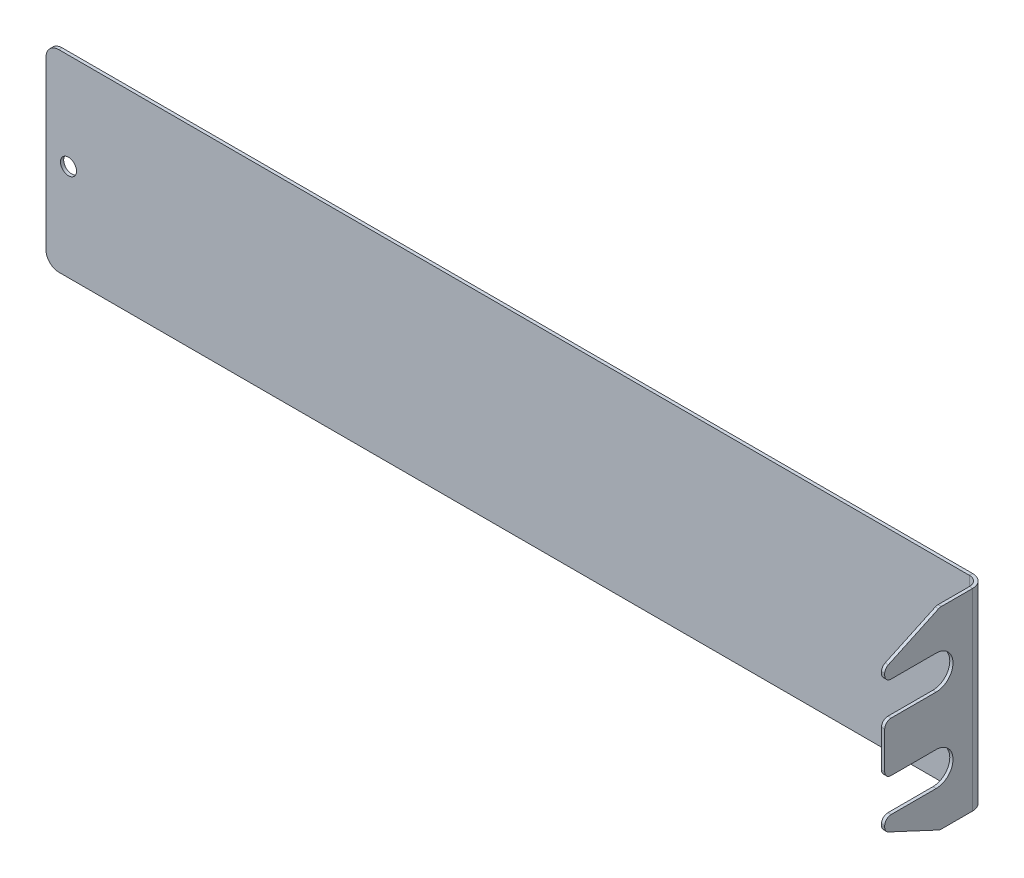
ISO-10303-21;
HEADER;
FILE_DESCRIPTION(('STEP AP214'),'2;1');
FILE_NAME('part.step','',(''),(''),'','','');
FILE_SCHEMA(('AUTOMOTIVE_DESIGN { 1 0 10303 214 1 1 1 1 }'));
ENDSEC;
DATA;
#1=APPLICATION_CONTEXT('core data for automotive mechanical design processes');
#2=APPLICATION_PROTOCOL_DEFINITION('international standard','automotive_design',2000,#1);
#3=PRODUCT_CONTEXT('',#1,'mechanical');
#4=PRODUCT('Part','Part','',(#3));
#5=PRODUCT_RELATED_PRODUCT_CATEGORY('part','',(#4));
#6=PRODUCT_DEFINITION_FORMATION('','',#4);
#7=PRODUCT_DEFINITION_CONTEXT('part definition',#1,'design');
#8=PRODUCT_DEFINITION('design','',#6,#7);
#9=PRODUCT_DEFINITION_SHAPE('','',#8);
#10=(LENGTH_UNIT() NAMED_UNIT(*) SI_UNIT(.MILLI.,.METRE.));
#11=(NAMED_UNIT(*) PLANE_ANGLE_UNIT() SI_UNIT($,.RADIAN.));
#12=(NAMED_UNIT(*) SI_UNIT($,.STERADIAN.) SOLID_ANGLE_UNIT());
#13=UNCERTAINTY_MEASURE_WITH_UNIT(LENGTH_MEASURE(1.E-05),#10,'distance_accuracy_value','');
#14=(GEOMETRIC_REPRESENTATION_CONTEXT(3) GLOBAL_UNCERTAINTY_ASSIGNED_CONTEXT((#13)) GLOBAL_UNIT_ASSIGNED_CONTEXT((#10,
#11,#12)) REPRESENTATION_CONTEXT('',''));
#15=CARTESIAN_POINT('',(0.,0.,0.));
#16=DIRECTION('',(0.,0.,1.));
#17=DIRECTION('',(1.,0.,0.));
#18=AXIS2_PLACEMENT_3D('',#15,#16,#17);
#19=CARTESIAN_POINT('',(0.384624115886447,13.,15.3846241158865));
#20=DIRECTION('',(-1.,0.,0.));
#21=DIRECTION('',(0.,0.,1.));
#22=AXIS2_PLACEMENT_3D('',#19,#20,#21);
#23=PLANE('',#22);
#24=DIRECTION('',(0.,0.,-1.));
#25=VECTOR('',#24,1.);
#26=CARTESIAN_POINT('',(0.38462411588645,30.,13.7851794265242));
#27=LINE('',#26,#25);
#28=CARTESIAN_POINT('',(0.38462411588645,30.,13.7851794265242));
#29=VERTEX_POINT('',#28);
#30=CARTESIAN_POINT('',(0.384624115886484,30.,4.00000000000001));
#31=VERTEX_POINT('',#30);
#32=EDGE_CURVE('E299',#29,#31,#27,.T.);
#33=ORIENTED_EDGE('',*,*,#32,.T.);
#34=DIRECTION('',(0.,-1.,0.));
#35=VECTOR('',#34,1.);
#36=CARTESIAN_POINT('',(0.384624115886487,13.,4.00000000000001));
#37=LINE('',#36,#35);
#38=CARTESIAN_POINT('',(0.384624115886492,-30.0000000000001,4.00000000000001));
#39=VERTEX_POINT('',#38);
#40=EDGE_CURVE('E429',#31,#39,#37,.T.);
#41=ORIENTED_EDGE('',*,*,#40,.T.);
#42=DIRECTION('',(0.,0.,1.));
#43=VECTOR('',#42,1.);
#44=CARTESIAN_POINT('',(0.384624115886458,-30.,13.7851794265242));
#45=LINE('',#44,#43);
#46=CARTESIAN_POINT('',(0.384624115886458,-30.,13.7851794265242));
#47=VERTEX_POINT('',#46);
#48=EDGE_CURVE('E302',#39,#47,#45,.T.);
#49=ORIENTED_EDGE('',*,*,#48,.T.);
#50=CARTESIAN_POINT('',(0.384624115886457,-28.,13.7851794265242));
#51=DIRECTION('',(-1.,0.,0.));
#52=DIRECTION('',(0.,0.,-1.));
#53=AXIS2_PLACEMENT_3D('',#50,#51,#52);
#54=CIRCLE('',#53,2.00000000000001);
#55=CARTESIAN_POINT('',(0.384624115886455,-29.8126155740733,14.6304159500056));
#56=VERTEX_POINT('',#55);
#57=EDGE_CURVE('E304',#47,#56,#54,.T.);
#58=ORIENTED_EDGE('',*,*,#57,.T.);
#59=DIRECTION('',(0.,0.4226182617407,0.90630778703665));
#60=VECTOR('',#59,1.);
#61=CARTESIAN_POINT('',(0.384624115886399,-22.5384750524583,30.2298606393679));
#62=LINE('',#61,#60);
#63=CARTESIAN_POINT('',(0.384624115886399,-22.5384750524583,30.2298606393679));
#64=VERTEX_POINT('',#63);
#65=EDGE_CURVE('E306',#56,#64,#62,.T.);
#66=ORIENTED_EDGE('',*,*,#65,.T.);
#67=CARTESIAN_POINT('',(0.384624115886402,-20.725859478385,29.3846241158865));
#68=DIRECTION('',(-1.,0.,0.));
#69=DIRECTION('',(0.,0.,1.));
#70=AXIS2_PLACEMENT_3D('',#67,#68,#69);
#71=CIRCLE('',#70,2.);
#72=CARTESIAN_POINT('',(0.384624115886395,-20.725859478385,31.3846241158865));
#73=VERTEX_POINT('',#72);
#74=EDGE_CURVE('E308',#64,#73,#71,.T.);
#75=ORIENTED_EDGE('',*,*,#74,.T.);
#76=DIRECTION('',(0.,1.,0.));
#77=VECTOR('',#76,1.);
#78=CARTESIAN_POINT('',(0.384624115886395,-20.25,31.3846241158865));
#79=LINE('',#78,#77);
#80=CARTESIAN_POINT('',(0.384624115886395,-20.25,31.3846241158865));
#81=VERTEX_POINT('',#80);
#82=EDGE_CURVE('E310',#73,#81,#79,.T.);
#83=ORIENTED_EDGE('',*,*,#82,.T.);
#84=CARTESIAN_POINT('',(0.384624115886402,-20.25,29.3846241158865));
#85=DIRECTION('',(-1.,0.,0.));
#86=DIRECTION('',(0.,0.,1.));
#87=AXIS2_PLACEMENT_3D('',#84,#85,#86);
#88=CIRCLE('',#87,2.00000000000001);
#89=CARTESIAN_POINT('',(0.384624115886402,-18.25,29.3846241158865));
#90=VERTEX_POINT('',#89);
#91=EDGE_CURVE('E312',#81,#90,#88,.T.);
#92=ORIENTED_EDGE('',*,*,#91,.T.);
#93=DIRECTION('',(0.,0.,-1.));
#94=VECTOR('',#93,1.);
#95=CARTESIAN_POINT('',(0.384624115886451,-18.25,15.3846241158865));
#96=LINE('',#95,#94);
#97=CARTESIAN_POINT('',(0.384624115886451,-18.25,15.3846241158865));
#98=VERTEX_POINT('',#97);
#99=EDGE_CURVE('E314',#90,#98,#96,.T.);
#100=ORIENTED_EDGE('',*,*,#99,.T.);
#101=CARTESIAN_POINT('',(0.38462411588645,-13.,15.3846241158865));
#102=DIRECTION('',(1.,0.,0.));
#103=DIRECTION('',(0.,0.,-1.));
#104=AXIS2_PLACEMENT_3D('',#101,#102,#103);
#105=CIRCLE('',#104,5.25);
#106=CARTESIAN_POINT('',(0.384624115886449,-7.75,15.3846241158865));
#107=VERTEX_POINT('',#106);
#108=EDGE_CURVE('E316',#98,#107,#105,.T.);
#109=ORIENTED_EDGE('',*,*,#108,.T.);
#110=DIRECTION('',(0.,0.,1.));
#111=VECTOR('',#110,1.);
#112=CARTESIAN_POINT('',(0.384624115886449,-7.75,15.3846241158865));
#113=LINE('',#112,#111);
#114=CARTESIAN_POINT('',(0.3846241158864,-7.74999999999999,29.3846241158865));
#115=VERTEX_POINT('',#114);
#116=EDGE_CURVE('E318',#107,#115,#113,.T.);
#117=ORIENTED_EDGE('',*,*,#116,.T.);
#118=CARTESIAN_POINT('',(0.3846241158864,-5.75,29.3846241158865));
#119=DIRECTION('',(-1.,0.,0.));
#120=DIRECTION('',(0.,0.,-1.));
#121=AXIS2_PLACEMENT_3D('',#118,#119,#120);
#122=CIRCLE('',#121,2.);
#123=CARTESIAN_POINT('',(0.384624115886393,-5.75,31.3846241158865));
#124=VERTEX_POINT('',#123);
#125=EDGE_CURVE('E320',#115,#124,#122,.T.);
#126=ORIENTED_EDGE('',*,*,#125,.T.);
#127=DIRECTION('',(0.,1.,0.));
#128=VECTOR('',#127,1.);
#129=CARTESIAN_POINT('',(0.384624115886392,5.75,31.3846241158865));
#130=LINE('',#129,#128);
#131=CARTESIAN_POINT('',(0.384624115886392,5.75,31.3846241158865));
#132=VERTEX_POINT('',#131);
#133=EDGE_CURVE('E322',#124,#132,#130,.T.);
#134=ORIENTED_EDGE('',*,*,#133,.T.);
#135=CARTESIAN_POINT('',(0.384624115886399,5.75,29.3846241158865));
#136=DIRECTION('',(-1.,0.,0.));
#137=DIRECTION('',(0.,0.,1.));
#138=AXIS2_PLACEMENT_3D('',#135,#136,#137);
#139=CIRCLE('',#138,2.);
#140=CARTESIAN_POINT('',(0.384624115886399,7.74999999999999,29.3846241158865));
#141=VERTEX_POINT('',#140);
#142=EDGE_CURVE('E324',#132,#141,#139,.T.);
#143=ORIENTED_EDGE('',*,*,#142,.T.);
#144=DIRECTION('',(0.,0.,-1.));
#145=VECTOR('',#144,1.);
#146=CARTESIAN_POINT('',(0.384624115886448,7.75,15.3846241158865));
#147=LINE('',#146,#145);
#148=CARTESIAN_POINT('',(0.384624115886448,7.75,15.3846241158865));
#149=VERTEX_POINT('',#148);
#150=EDGE_CURVE('E326',#141,#149,#147,.T.);
#151=ORIENTED_EDGE('',*,*,#150,.T.);
#152=CARTESIAN_POINT('',(0.384624115886447,13.,15.3846241158865));
#153=DIRECTION('',(1.,0.,0.));
#154=DIRECTION('',(0.,0.,1.));
#155=AXIS2_PLACEMENT_3D('',#152,#153,#154);
#156=CIRCLE('',#155,5.25);
#157=CARTESIAN_POINT('',(0.384624115886446,18.25,15.3846241158865));
#158=VERTEX_POINT('',#157);
#159=EDGE_CURVE('E283',#149,#158,#156,.T.);
#160=ORIENTED_EDGE('',*,*,#159,.T.);
#161=DIRECTION('',(0.,0.,1.));
#162=VECTOR('',#161,1.);
#163=CARTESIAN_POINT('',(0.384624115886446,18.25,15.3846241158865));
#164=LINE('',#163,#162);
#165=CARTESIAN_POINT('',(0.384624115886397,18.25,29.3846241158865));
#166=VERTEX_POINT('',#165);
#167=EDGE_CURVE('E286',#158,#166,#164,.T.);
#168=ORIENTED_EDGE('',*,*,#167,.T.);
#169=CARTESIAN_POINT('',(0.384624115886397,20.25,29.3846241158865));
#170=DIRECTION('',(-1.,0.,0.));
#171=DIRECTION('',(0.,0.,-1.));
#172=AXIS2_PLACEMENT_3D('',#169,#170,#171);
#173=CIRCLE('',#172,2.);
#174=CARTESIAN_POINT('',(0.38462411588639,20.25,31.3846241158865));
#175=VERTEX_POINT('',#174);
#176=EDGE_CURVE('E289',#166,#175,#173,.T.);
#177=ORIENTED_EDGE('',*,*,#176,.T.);
#178=DIRECTION('',(0.,1.,0.));
#179=VECTOR('',#178,1.);
#180=CARTESIAN_POINT('',(0.38462411588639,20.25,31.3846241158865));
#181=LINE('',#180,#179);
#182=CARTESIAN_POINT('',(0.38462411588639,20.725859478385,31.3846241158865));
#183=VERTEX_POINT('',#182);
#184=EDGE_CURVE('E291',#175,#183,#181,.T.);
#185=ORIENTED_EDGE('',*,*,#184,.T.);
#186=CARTESIAN_POINT('',(0.384624115886397,20.725859478385,29.3846241158865));
#187=DIRECTION('',(-1.,0.,0.));
#188=DIRECTION('',(0.,0.,-1.));
#189=AXIS2_PLACEMENT_3D('',#186,#187,#188);
#190=CIRCLE('',#189,2.);
#191=CARTESIAN_POINT('',(0.384624115886394,22.5384750524583,30.2298606393679));
#192=VERTEX_POINT('',#191);
#193=EDGE_CURVE('E293',#183,#192,#190,.T.);
#194=ORIENTED_EDGE('',*,*,#193,.T.);
#195=DIRECTION('',(0.,0.4226182617407,-0.90630778703665));
#196=VECTOR('',#195,1.);
#197=CARTESIAN_POINT('',(0.384624115886394,22.5384750524583,30.2298606393679));
#198=LINE('',#197,#196);
#199=CARTESIAN_POINT('',(0.384624115886447,29.8126155740733,14.6304159500056));
#200=VERTEX_POINT('',#199);
#201=EDGE_CURVE('E295',#192,#200,#198,.T.);
#202=ORIENTED_EDGE('',*,*,#201,.T.);
#203=CARTESIAN_POINT('',(0.38462411588645,28.,13.7851794265242));
#204=DIRECTION('',(-1.,0.,0.));
#205=DIRECTION('',(0.,0.,1.));
#206=AXIS2_PLACEMENT_3D('',#203,#204,#205);
#207=CIRCLE('',#206,2.00000000000001);
#208=EDGE_CURVE('E297',#200,#29,#207,.T.);
#209=ORIENTED_EDGE('',*,*,#208,.T.);
#210=EDGE_LOOP('',(#33,#41,#49,#58,#66,#75,#83,#92,#100,#109,#117,#126,#134,#143,#151,#160,#168,
#177,#185,#194,#202,#209));
#211=FACE_BOUND('',#210,.T.);
#212=ADVANCED_FACE('F39',(#211),#23,.T.);
#213=CARTESIAN_POINT('',(1.38462411588645,13.,15.3846241158865));
#214=DIRECTION('',(-1.,0.,0.));
#215=DIRECTION('',(0.,0.,1.));
#216=AXIS2_PLACEMENT_3D('',#213,#214,#215);
#217=PLANE('',#216);
#218=DIRECTION('',(0.,-1.,0.));
#219=VECTOR('',#218,1.);
#220=CARTESIAN_POINT('',(1.38462411588649,13.,4.00000000000001));
#221=LINE('',#220,#219);
#222=CARTESIAN_POINT('',(1.38462411588648,30.,4.00000000000001));
#223=VERTEX_POINT('',#222);
#224=CARTESIAN_POINT('',(1.38462411588649,-30.,4.00000000000001));
#225=VERTEX_POINT('',#224);
#226=EDGE_CURVE('E54',#223,#225,#221,.T.);
#227=ORIENTED_EDGE('',*,*,#226,.F.);
#228=DIRECTION('',(0.,0.,-1.));
#229=VECTOR('',#228,1.);
#230=CARTESIAN_POINT('',(1.38462411588645,30.,13.7851794265242));
#231=LINE('',#230,#229);
#232=CARTESIAN_POINT('',(1.38462411588645,30.,13.7851794265242));
#233=VERTEX_POINT('',#232);
#234=EDGE_CURVE('E343',#233,#223,#231,.T.);
#235=ORIENTED_EDGE('',*,*,#234,.F.);
#236=CARTESIAN_POINT('',(1.38462411588645,28.,13.7851794265242));
#237=DIRECTION('',(-1.,0.,0.));
#238=DIRECTION('',(0.,0.,1.));
#239=AXIS2_PLACEMENT_3D('',#236,#237,#238);
#240=CIRCLE('',#239,2.00000000000001);
#241=CARTESIAN_POINT('',(1.38462411588645,29.8126155740733,14.6304159500056));
#242=VERTEX_POINT('',#241);
#243=EDGE_CURVE('E341',#242,#233,#240,.T.);
#244=ORIENTED_EDGE('',*,*,#243,.F.);
#245=DIRECTION('',(0.,0.4226182617407,-0.90630778703665));
#246=VECTOR('',#245,1.);
#247=CARTESIAN_POINT('',(1.38462411588639,22.5384750524583,30.2298606393679));
#248=LINE('',#247,#246);
#249=CARTESIAN_POINT('',(1.38462411588639,22.5384750524583,30.2298606393679));
#250=VERTEX_POINT('',#249);
#251=EDGE_CURVE('E339',#250,#242,#248,.T.);
#252=ORIENTED_EDGE('',*,*,#251,.F.);
#253=CARTESIAN_POINT('',(1.3846241158864,20.725859478385,29.3846241158865));
#254=DIRECTION('',(-1.,0.,0.));
#255=DIRECTION('',(0.,0.,-1.));
#256=AXIS2_PLACEMENT_3D('',#253,#254,#255);
#257=CIRCLE('',#256,2.);
#258=CARTESIAN_POINT('',(1.38462411588639,20.725859478385,31.3846241158865));
#259=VERTEX_POINT('',#258);
#260=EDGE_CURVE('E337',#259,#250,#257,.T.);
#261=ORIENTED_EDGE('',*,*,#260,.F.);
#262=DIRECTION('',(0.,1.,0.));
#263=VECTOR('',#262,1.);
#264=CARTESIAN_POINT('',(1.38462411588639,20.25,31.3846241158865));
#265=LINE('',#264,#263);
#266=CARTESIAN_POINT('',(1.38462411588639,20.25,31.3846241158865));
#267=VERTEX_POINT('',#266);
#268=EDGE_CURVE('E335',#267,#259,#265,.T.);
#269=ORIENTED_EDGE('',*,*,#268,.F.);
#270=CARTESIAN_POINT('',(1.3846241158864,20.25,29.3846241158865));
#271=DIRECTION('',(-1.,0.,0.));
#272=DIRECTION('',(0.,0.,-1.));
#273=AXIS2_PLACEMENT_3D('',#270,#271,#272);
#274=CIRCLE('',#273,2.);
#275=CARTESIAN_POINT('',(1.3846241158864,18.25,29.3846241158865));
#276=VERTEX_POINT('',#275);
#277=EDGE_CURVE('E333',#276,#267,#274,.T.);
#278=ORIENTED_EDGE('',*,*,#277,.F.);
#279=DIRECTION('',(0.,0.,1.));
#280=VECTOR('',#279,1.);
#281=CARTESIAN_POINT('',(1.38462411588645,18.25,15.3846241158865));
#282=LINE('',#281,#280);
#283=CARTESIAN_POINT('',(1.38462411588645,18.25,15.3846241158865));
#284=VERTEX_POINT('',#283);
#285=EDGE_CURVE('E331',#284,#276,#282,.T.);
#286=ORIENTED_EDGE('',*,*,#285,.F.);
#287=CARTESIAN_POINT('',(1.38462411588645,13.,15.3846241158865));
#288=DIRECTION('',(1.,0.,0.));
#289=DIRECTION('',(0.,0.,1.));
#290=AXIS2_PLACEMENT_3D('',#287,#288,#289);
#291=CIRCLE('',#290,5.25);
#292=CARTESIAN_POINT('',(1.38462411588645,7.75,15.3846241158865));
#293=VERTEX_POINT('',#292);
#294=EDGE_CURVE('E282',#293,#284,#291,.T.);
#295=ORIENTED_EDGE('',*,*,#294,.F.);
#296=DIRECTION('',(0.,0.,-1.));
#297=VECTOR('',#296,1.);
#298=CARTESIAN_POINT('',(1.38462411588645,7.75,15.3846241158865));
#299=LINE('',#298,#297);
#300=CARTESIAN_POINT('',(1.3846241158864,7.74999999999999,29.3846241158865));
#301=VERTEX_POINT('',#300);
#302=EDGE_CURVE('E287',#301,#293,#299,.T.);
#303=ORIENTED_EDGE('',*,*,#302,.F.);
#304=CARTESIAN_POINT('',(1.3846241158864,5.75,29.3846241158865));
#305=DIRECTION('',(-1.,0.,0.));
#306=DIRECTION('',(0.,0.,1.));
#307=AXIS2_PLACEMENT_3D('',#304,#305,#306);
#308=CIRCLE('',#307,2.);
#309=CARTESIAN_POINT('',(1.38462411588639,5.75,31.3846241158865));
#310=VERTEX_POINT('',#309);
#311=EDGE_CURVE('E367',#310,#301,#308,.T.);
#312=ORIENTED_EDGE('',*,*,#311,.F.);
#313=DIRECTION('',(0.,1.,0.));
#314=VECTOR('',#313,1.);
#315=CARTESIAN_POINT('',(1.38462411588639,5.75,31.3846241158865));
#316=LINE('',#315,#314);
#317=CARTESIAN_POINT('',(1.38462411588639,-5.75,31.3846241158865));
#318=VERTEX_POINT('',#317);
#319=EDGE_CURVE('E365',#318,#310,#316,.T.);
#320=ORIENTED_EDGE('',*,*,#319,.F.);
#321=CARTESIAN_POINT('',(1.3846241158864,-5.75,29.3846241158865));
#322=DIRECTION('',(-1.,0.,0.));
#323=DIRECTION('',(0.,0.,-1.));
#324=AXIS2_PLACEMENT_3D('',#321,#322,#323);
#325=CIRCLE('',#324,2.);
#326=CARTESIAN_POINT('',(1.3846241158864,-7.74999999999999,29.3846241158865));
#327=VERTEX_POINT('',#326);
#328=EDGE_CURVE('E363',#327,#318,#325,.T.);
#329=ORIENTED_EDGE('',*,*,#328,.F.);
#330=DIRECTION('',(0.,0.,1.));
#331=VECTOR('',#330,1.);
#332=CARTESIAN_POINT('',(1.38462411588645,-7.75,15.3846241158865));
#333=LINE('',#332,#331);
#334=CARTESIAN_POINT('',(1.38462411588645,-7.75,15.3846241158865));
#335=VERTEX_POINT('',#334);
#336=EDGE_CURVE('E361',#335,#327,#333,.T.);
#337=ORIENTED_EDGE('',*,*,#336,.F.);
#338=CARTESIAN_POINT('',(1.38462411588645,-13.,15.3846241158865));
#339=DIRECTION('',(1.,0.,0.));
#340=DIRECTION('',(0.,0.,-1.));
#341=AXIS2_PLACEMENT_3D('',#338,#339,#340);
#342=CIRCLE('',#341,5.25);
#343=CARTESIAN_POINT('',(1.38462411588645,-18.25,15.3846241158865));
#344=VERTEX_POINT('',#343);
#345=EDGE_CURVE('E359',#344,#335,#342,.T.);
#346=ORIENTED_EDGE('',*,*,#345,.F.);
#347=DIRECTION('',(0.,0.,-1.));
#348=VECTOR('',#347,1.);
#349=CARTESIAN_POINT('',(1.38462411588645,-18.25,15.3846241158865));
#350=LINE('',#349,#348);
#351=CARTESIAN_POINT('',(1.3846241158864,-18.25,29.3846241158865));
#352=VERTEX_POINT('',#351);
#353=EDGE_CURVE('E357',#352,#344,#350,.T.);
#354=ORIENTED_EDGE('',*,*,#353,.F.);
#355=CARTESIAN_POINT('',(1.3846241158864,-20.25,29.3846241158865));
#356=DIRECTION('',(-1.,0.,0.));
#357=DIRECTION('',(0.,0.,1.));
#358=AXIS2_PLACEMENT_3D('',#355,#356,#357);
#359=CIRCLE('',#358,2.00000000000001);
#360=CARTESIAN_POINT('',(1.3846241158864,-20.25,31.3846241158865));
#361=VERTEX_POINT('',#360);
#362=EDGE_CURVE('E355',#361,#352,#359,.T.);
#363=ORIENTED_EDGE('',*,*,#362,.F.);
#364=DIRECTION('',(0.,1.,0.));
#365=VECTOR('',#364,1.);
#366=CARTESIAN_POINT('',(1.3846241158864,-20.25,31.3846241158865));
#367=LINE('',#366,#365);
#368=CARTESIAN_POINT('',(1.3846241158864,-20.725859478385,31.3846241158865));
#369=VERTEX_POINT('',#368);
#370=EDGE_CURVE('E353',#369,#361,#367,.T.);
#371=ORIENTED_EDGE('',*,*,#370,.F.);
#372=CARTESIAN_POINT('',(1.3846241158864,-20.725859478385,29.3846241158865));
#373=DIRECTION('',(-1.,0.,0.));
#374=DIRECTION('',(0.,0.,1.));
#375=AXIS2_PLACEMENT_3D('',#372,#373,#374);
#376=CIRCLE('',#375,2.);
#377=CARTESIAN_POINT('',(1.3846241158864,-22.5384750524583,30.2298606393679));
#378=VERTEX_POINT('',#377);
#379=EDGE_CURVE('E351',#378,#369,#376,.T.);
#380=ORIENTED_EDGE('',*,*,#379,.F.);
#381=DIRECTION('',(0.,0.4226182617407,0.90630778703665));
#382=VECTOR('',#381,1.);
#383=CARTESIAN_POINT('',(1.3846241158864,-22.5384750524583,30.2298606393679));
#384=LINE('',#383,#382);
#385=CARTESIAN_POINT('',(1.38462411588645,-29.8126155740733,14.6304159500056));
#386=VERTEX_POINT('',#385);
#387=EDGE_CURVE('E349',#386,#378,#384,.T.);
#388=ORIENTED_EDGE('',*,*,#387,.F.);
#389=CARTESIAN_POINT('',(1.38462411588646,-28.,13.7851794265242));
#390=DIRECTION('',(-1.,0.,0.));
#391=DIRECTION('',(0.,0.,-1.));
#392=AXIS2_PLACEMENT_3D('',#389,#390,#391);
#393=CIRCLE('',#392,2.00000000000001);
#394=CARTESIAN_POINT('',(1.38462411588646,-30.,13.7851794265242));
#395=VERTEX_POINT('',#394);
#396=EDGE_CURVE('E347',#395,#386,#393,.T.);
#397=ORIENTED_EDGE('',*,*,#396,.F.);
#398=DIRECTION('',(0.,0.,1.));
#399=VECTOR('',#398,1.);
#400=CARTESIAN_POINT('',(1.38462411588646,-30.,13.7851794265242));
#401=LINE('',#400,#399);
#402=EDGE_CURVE('E345',#225,#395,#401,.T.);
#403=ORIENTED_EDGE('',*,*,#402,.F.);
#404=EDGE_LOOP('',(#227,#235,#244,#252,#261,#269,#278,#286,#295,#303,#312,#320,#329,#337,#346,
#354,#363,#371,#380,#388,#397,#403));
#405=FACE_BOUND('',#404,.T.);
#406=ADVANCED_FACE('F487',(#405),#217,.F.);
#407=CARTESIAN_POINT('',(0.384624115886447,13.,15.3846241158865));
#408=DIRECTION('',(1.,0.,0.));
#409=DIRECTION('',(0.,0.,-1.));
#410=AXIS2_PLACEMENT_3D('',#407,#408,#409);
#411=CYLINDRICAL_SURFACE('',#410,5.25);
#412=ORIENTED_EDGE('',*,*,#294,.T.);
#413=DIRECTION('',(1.,0.,0.));
#414=VECTOR('',#413,1.);
#415=CARTESIAN_POINT('',(0.384624115886446,18.25,15.3846241158865));
#416=LINE('',#415,#414);
#417=EDGE_CURVE('E426',#158,#284,#416,.T.);
#418=ORIENTED_EDGE('',*,*,#417,.F.);
#419=ORIENTED_EDGE('',*,*,#159,.F.);
#420=DIRECTION('',(1.,0.,0.));
#421=VECTOR('',#420,1.);
#422=CARTESIAN_POINT('',(0.384624115886448,7.75,15.3846241158865));
#423=LINE('',#422,#421);
#424=EDGE_CURVE('E328',#149,#293,#423,.T.);
#425=ORIENTED_EDGE('',*,*,#424,.T.);
#426=EDGE_LOOP('',(#412,#418,#419,#425));
#427=FACE_BOUND('',#426,.T.);
#428=ADVANCED_FACE('F41',(#427),#411,.F.);
#429=CARTESIAN_POINT('',(0.384624115886446,18.25,15.3846241158865));
#430=DIRECTION('',(0.,1.,0.));
#431=DIRECTION('',(0.,0.,-1.));
#432=AXIS2_PLACEMENT_3D('',#429,#430,#431);
#433=PLANE('',#432);
#434=ORIENTED_EDGE('',*,*,#285,.T.);
#435=DIRECTION('',(1.,0.,0.));
#436=VECTOR('',#435,1.);
#437=CARTESIAN_POINT('',(0.384624115886397,18.25,29.3846241158865));
#438=LINE('',#437,#436);
#439=EDGE_CURVE('E423',#166,#276,#438,.T.);
#440=ORIENTED_EDGE('',*,*,#439,.F.);
#441=ORIENTED_EDGE('',*,*,#167,.F.);
#442=ORIENTED_EDGE('',*,*,#417,.T.);
#443=EDGE_LOOP('',(#434,#440,#441,#442));
#444=FACE_BOUND('',#443,.T.);
#445=ADVANCED_FACE('F511',(#444),#433,.F.);
#446=CARTESIAN_POINT('',(0.384624115886397,20.25,29.3846241158865));
#447=DIRECTION('',(1.,0.,0.));
#448=DIRECTION('',(0.,0.,-1.));
#449=AXIS2_PLACEMENT_3D('',#446,#447,#448);
#450=CYLINDRICAL_SURFACE('',#449,2.);
#451=ORIENTED_EDGE('',*,*,#277,.T.);
#452=DIRECTION('',(1.,0.,0.));
#453=VECTOR('',#452,1.);
#454=CARTESIAN_POINT('',(0.38462411588639,20.25,31.3846241158865));
#455=LINE('',#454,#453);
#456=EDGE_CURVE('E420',#175,#267,#455,.T.);
#457=ORIENTED_EDGE('',*,*,#456,.F.);
#458=ORIENTED_EDGE('',*,*,#176,.F.);
#459=ORIENTED_EDGE('',*,*,#439,.T.);
#460=EDGE_LOOP('',(#451,#457,#458,#459));
#461=FACE_BOUND('',#460,.T.);
#462=ADVANCED_FACE('F508',(#461),#450,.T.);
#463=CARTESIAN_POINT('',(0.38462411588639,20.25,31.3846241158865));
#464=DIRECTION('',(0.,0.,-1.));
#465=DIRECTION('',(0.,-1.,0.));
#466=AXIS2_PLACEMENT_3D('',#463,#464,#465);
#467=PLANE('',#466);
#468=ORIENTED_EDGE('',*,*,#268,.T.);
#469=DIRECTION('',(1.,0.,0.));
#470=VECTOR('',#469,1.);
#471=CARTESIAN_POINT('',(0.38462411588639,20.725859478385,31.3846241158865));
#472=LINE('',#471,#470);
#473=EDGE_CURVE('E417',#183,#259,#472,.T.);
#474=ORIENTED_EDGE('',*,*,#473,.F.);
#475=ORIENTED_EDGE('',*,*,#184,.F.);
#476=ORIENTED_EDGE('',*,*,#456,.T.);
#477=EDGE_LOOP('',(#468,#474,#475,#476));
#478=FACE_BOUND('',#477,.T.);
#479=ADVANCED_FACE('F503',(#478),#467,.F.);
#480=CARTESIAN_POINT('',(0.384624115886397,20.725859478385,29.3846241158865));
#481=DIRECTION('',(1.,0.,0.));
#482=DIRECTION('',(0.,0.,-1.));
#483=AXIS2_PLACEMENT_3D('',#480,#481,#482);
#484=CYLINDRICAL_SURFACE('',#483,2.);
#485=ORIENTED_EDGE('',*,*,#260,.T.);
#486=DIRECTION('',(1.,0.,0.));
#487=VECTOR('',#486,1.);
#488=CARTESIAN_POINT('',(0.384624115886394,22.5384750524583,30.2298606393679));
#489=LINE('',#488,#487);
#490=EDGE_CURVE('E414',#192,#250,#489,.T.);
#491=ORIENTED_EDGE('',*,*,#490,.F.);
#492=ORIENTED_EDGE('',*,*,#193,.F.);
#493=ORIENTED_EDGE('',*,*,#473,.T.);
#494=EDGE_LOOP('',(#485,#491,#492,#493));
#495=FACE_BOUND('',#494,.T.);
#496=ADVANCED_FACE('F498',(#495),#484,.T.);
#497=CARTESIAN_POINT('',(0.384624115886394,22.5384750524583,30.2298606393679));
#498=DIRECTION('',(0.,-0.90630778703665,-0.4226182617407));
#499=DIRECTION('',(0.,-0.4226182617407,0.90630778703665));
#500=AXIS2_PLACEMENT_3D('',#497,#498,#499);
#501=PLANE('',#500);
#502=ORIENTED_EDGE('',*,*,#251,.T.);
#503=DIRECTION('',(1.,0.,0.));
#504=VECTOR('',#503,1.);
#505=CARTESIAN_POINT('',(0.384624115886447,29.8126155740733,14.6304159500056));
#506=LINE('',#505,#504);
#507=EDGE_CURVE('E411',#200,#242,#506,.T.);
#508=ORIENTED_EDGE('',*,*,#507,.F.);
#509=ORIENTED_EDGE('',*,*,#201,.F.);
#510=ORIENTED_EDGE('',*,*,#490,.T.);
#511=EDGE_LOOP('',(#502,#508,#509,#510));
#512=FACE_BOUND('',#511,.T.);
#513=ADVANCED_FACE('F494',(#512),#501,.F.);
#514=CARTESIAN_POINT('',(0.38462411588645,28.,13.7851794265242));
#515=DIRECTION('',(1.,0.,0.));
#516=DIRECTION('',(0.,0.,-1.));
#517=AXIS2_PLACEMENT_3D('',#514,#515,#516);
#518=CYLINDRICAL_SURFACE('',#517,2.00000000000001);
#519=ORIENTED_EDGE('',*,*,#243,.T.);
#520=DIRECTION('',(1.,0.,0.));
#521=VECTOR('',#520,1.);
#522=CARTESIAN_POINT('',(0.38462411588645,30.,13.7851794265242));
#523=LINE('',#522,#521);
#524=EDGE_CURVE('E408',#29,#233,#523,.T.);
#525=ORIENTED_EDGE('',*,*,#524,.F.);
#526=ORIENTED_EDGE('',*,*,#208,.F.);
#527=ORIENTED_EDGE('',*,*,#507,.T.);
#528=EDGE_LOOP('',(#519,#525,#526,#527));
#529=FACE_BOUND('',#528,.T.);
#530=ADVANCED_FACE('F490',(#529),#518,.T.);
#531=CARTESIAN_POINT('',(0.38462411588645,30.,13.7851794265242));
#532=DIRECTION('',(0.,-1.,0.));
#533=DIRECTION('',(0.,0.,1.));
#534=AXIS2_PLACEMENT_3D('',#531,#532,#533);
#535=PLANE('',#534);
#536=DIRECTION('',(1.,0.,0.));
#537=VECTOR('',#536,1.);
#538=CARTESIAN_POINT('',(0.384624115886484,30.,4.00000000000001));
#539=LINE('',#538,#537);
#540=EDGE_CURVE('E47',#31,#223,#539,.T.);
#541=ORIENTED_EDGE('',*,*,#540,.F.);
#542=ORIENTED_EDGE('',*,*,#32,.F.);
#543=ORIENTED_EDGE('',*,*,#524,.T.);
#544=ORIENTED_EDGE('',*,*,#234,.T.);
#545=EDGE_LOOP('',(#541,#542,#543,#544));
#546=FACE_BOUND('',#545,.T.);
#547=ADVANCED_FACE('F484',(#546),#535,.F.);
#548=CARTESIAN_POINT('',(0.384624115886458,-30.,13.7851794265242));
#549=DIRECTION('',(0.,1.,0.));
#550=DIRECTION('',(0.,0.,-1.));
#551=AXIS2_PLACEMENT_3D('',#548,#549,#550);
#552=PLANE('',#551);
#553=DIRECTION('',(-1.,0.,0.));
#554=VECTOR('',#553,1.);
#555=CARTESIAN_POINT('',(0.384624115886492,-30.,4.00000000000001));
#556=LINE('',#555,#554);
#557=EDGE_CURVE('E11',#225,#39,#556,.T.);
#558=ORIENTED_EDGE('',*,*,#557,.F.);
#559=ORIENTED_EDGE('',*,*,#402,.T.);
#560=DIRECTION('',(1.,0.,0.));
#561=VECTOR('',#560,1.);
#562=CARTESIAN_POINT('',(0.384624115886458,-30.,13.7851794265242));
#563=LINE('',#562,#561);
#564=EDGE_CURVE('E405',#47,#395,#563,.T.);
#565=ORIENTED_EDGE('',*,*,#564,.F.);
#566=ORIENTED_EDGE('',*,*,#48,.F.);
#567=EDGE_LOOP('',(#558,#559,#565,#566));
#568=FACE_BOUND('',#567,.T.);
#569=ADVANCED_FACE('F576',(#568),#552,.F.);
#570=CARTESIAN_POINT('',(0.384624115886457,-28.,13.7851794265242));
#571=DIRECTION('',(1.,0.,0.));
#572=DIRECTION('',(0.,0.,-1.));
#573=AXIS2_PLACEMENT_3D('',#570,#571,#572);
#574=CYLINDRICAL_SURFACE('',#573,2.00000000000001);
#575=ORIENTED_EDGE('',*,*,#396,.T.);
#576=DIRECTION('',(1.,0.,0.));
#577=VECTOR('',#576,1.);
#578=CARTESIAN_POINT('',(0.384624115886455,-29.8126155740733,14.6304159500056));
#579=LINE('',#578,#577);
#580=EDGE_CURVE('E402',#56,#386,#579,.T.);
#581=ORIENTED_EDGE('',*,*,#580,.F.);
#582=ORIENTED_EDGE('',*,*,#57,.F.);
#583=ORIENTED_EDGE('',*,*,#564,.T.);
#584=EDGE_LOOP('',(#575,#581,#582,#583));
#585=FACE_BOUND('',#584,.T.);
#586=ADVANCED_FACE('F574',(#585),#574,.T.);
#587=CARTESIAN_POINT('',(0.384624115886399,-22.5384750524583,30.2298606393679));
#588=DIRECTION('',(0.,0.90630778703665,-0.4226182617407));
#589=DIRECTION('',(0.,-0.4226182617407,-0.90630778703665));
#590=AXIS2_PLACEMENT_3D('',#587,#588,#589);
#591=PLANE('',#590);
#592=ORIENTED_EDGE('',*,*,#387,.T.);
#593=DIRECTION('',(1.,0.,0.));
#594=VECTOR('',#593,1.);
#595=CARTESIAN_POINT('',(0.384624115886399,-22.5384750524583,30.2298606393679));
#596=LINE('',#595,#594);
#597=EDGE_CURVE('E399',#64,#378,#596,.T.);
#598=ORIENTED_EDGE('',*,*,#597,.F.);
#599=ORIENTED_EDGE('',*,*,#65,.F.);
#600=ORIENTED_EDGE('',*,*,#580,.T.);
#601=EDGE_LOOP('',(#592,#598,#599,#600));
#602=FACE_BOUND('',#601,.T.);
#603=ADVANCED_FACE('F570',(#602),#591,.F.);
#604=CARTESIAN_POINT('',(0.384624115886402,-20.725859478385,29.3846241158865));
#605=DIRECTION('',(1.,0.,0.));
#606=DIRECTION('',(0.,0.,-1.));
#607=AXIS2_PLACEMENT_3D('',#604,#605,#606);
#608=CYLINDRICAL_SURFACE('',#607,2.);
#609=ORIENTED_EDGE('',*,*,#379,.T.);
#610=DIRECTION('',(1.,0.,0.));
#611=VECTOR('',#610,1.);
#612=CARTESIAN_POINT('',(0.384624115886395,-20.725859478385,31.3846241158865));
#613=LINE('',#612,#611);
#614=EDGE_CURVE('E396',#73,#369,#613,.T.);
#615=ORIENTED_EDGE('',*,*,#614,.F.);
#616=ORIENTED_EDGE('',*,*,#74,.F.);
#617=ORIENTED_EDGE('',*,*,#597,.T.);
#618=EDGE_LOOP('',(#609,#615,#616,#617));
#619=FACE_BOUND('',#618,.T.);
#620=ADVANCED_FACE('F566',(#619),#608,.T.);
#621=CARTESIAN_POINT('',(0.384624115886395,-20.25,31.3846241158865));
#622=DIRECTION('',(0.,0.,-1.));
#623=DIRECTION('',(0.,-1.,0.));
#624=AXIS2_PLACEMENT_3D('',#621,#622,#623);
#625=PLANE('',#624);
#626=ORIENTED_EDGE('',*,*,#370,.T.);
#627=DIRECTION('',(1.,0.,0.));
#628=VECTOR('',#627,1.);
#629=CARTESIAN_POINT('',(0.384624115886395,-20.25,31.3846241158865));
#630=LINE('',#629,#628);
#631=EDGE_CURVE('E393',#81,#361,#630,.T.);
#632=ORIENTED_EDGE('',*,*,#631,.F.);
#633=ORIENTED_EDGE('',*,*,#82,.F.);
#634=ORIENTED_EDGE('',*,*,#614,.T.);
#635=EDGE_LOOP('',(#626,#632,#633,#634));
#636=FACE_BOUND('',#635,.T.);
#637=ADVANCED_FACE('F561',(#636),#625,.F.);
#638=CARTESIAN_POINT('',(0.384624115886402,-20.25,29.3846241158865));
#639=DIRECTION('',(1.,0.,0.));
#640=DIRECTION('',(0.,0.,-1.));
#641=AXIS2_PLACEMENT_3D('',#638,#639,#640);
#642=CYLINDRICAL_SURFACE('',#641,2.00000000000001);
#643=ORIENTED_EDGE('',*,*,#362,.T.);
#644=DIRECTION('',(1.,0.,0.));
#645=VECTOR('',#644,1.);
#646=CARTESIAN_POINT('',(0.384624115886402,-18.25,29.3846241158865));
#647=LINE('',#646,#645);
#648=EDGE_CURVE('E390',#90,#352,#647,.T.);
#649=ORIENTED_EDGE('',*,*,#648,.F.);
#650=ORIENTED_EDGE('',*,*,#91,.F.);
#651=ORIENTED_EDGE('',*,*,#631,.T.);
#652=EDGE_LOOP('',(#643,#649,#650,#651));
#653=FACE_BOUND('',#652,.T.);
#654=ADVANCED_FACE('F555',(#653),#642,.T.);
#655=CARTESIAN_POINT('',(0.384624115886451,-18.25,15.3846241158865));
#656=DIRECTION('',(0.,-1.,0.));
#657=DIRECTION('',(0.,0.,1.));
#658=AXIS2_PLACEMENT_3D('',#655,#656,#657);
#659=PLANE('',#658);
#660=ORIENTED_EDGE('',*,*,#353,.T.);
#661=DIRECTION('',(1.,0.,0.));
#662=VECTOR('',#661,1.);
#663=CARTESIAN_POINT('',(0.384624115886451,-18.25,15.3846241158865));
#664=LINE('',#663,#662);
#665=EDGE_CURVE('E387',#98,#344,#664,.T.);
#666=ORIENTED_EDGE('',*,*,#665,.F.);
#667=ORIENTED_EDGE('',*,*,#99,.F.);
#668=ORIENTED_EDGE('',*,*,#648,.T.);
#669=EDGE_LOOP('',(#660,#666,#667,#668));
#670=FACE_BOUND('',#669,.T.);
#671=ADVANCED_FACE('F551',(#670),#659,.F.);
#672=CARTESIAN_POINT('',(0.38462411588645,-13.,15.3846241158865));
#673=DIRECTION('',(1.,0.,0.));
#674=DIRECTION('',(0.,0.,-1.));
#675=AXIS2_PLACEMENT_3D('',#672,#673,#674);
#676=CYLINDRICAL_SURFACE('',#675,5.25);
#677=ORIENTED_EDGE('',*,*,#345,.T.);
#678=DIRECTION('',(1.,0.,0.));
#679=VECTOR('',#678,1.);
#680=CARTESIAN_POINT('',(0.384624115886449,-7.75,15.3846241158865));
#681=LINE('',#680,#679);
#682=EDGE_CURVE('E384',#107,#335,#681,.T.);
#683=ORIENTED_EDGE('',*,*,#682,.F.);
#684=ORIENTED_EDGE('',*,*,#108,.F.);
#685=ORIENTED_EDGE('',*,*,#665,.T.);
#686=EDGE_LOOP('',(#677,#683,#684,#685));
#687=FACE_BOUND('',#686,.T.);
#688=ADVANCED_FACE('F546',(#687),#676,.F.);
#689=CARTESIAN_POINT('',(0.384624115886449,-7.75,15.3846241158865));
#690=DIRECTION('',(0.,1.,0.));
#691=DIRECTION('',(0.,0.,-1.));
#692=AXIS2_PLACEMENT_3D('',#689,#690,#691);
#693=PLANE('',#692);
#694=ORIENTED_EDGE('',*,*,#336,.T.);
#695=DIRECTION('',(1.,0.,0.));
#696=VECTOR('',#695,1.);
#697=CARTESIAN_POINT('',(0.3846241158864,-7.74999999999999,29.3846241158865));
#698=LINE('',#697,#696);
#699=EDGE_CURVE('E381',#115,#327,#698,.T.);
#700=ORIENTED_EDGE('',*,*,#699,.F.);
#701=ORIENTED_EDGE('',*,*,#116,.F.);
#702=ORIENTED_EDGE('',*,*,#682,.T.);
#703=EDGE_LOOP('',(#694,#700,#701,#702));
#704=FACE_BOUND('',#703,.T.);
#705=ADVANCED_FACE('F540',(#704),#693,.F.);
#706=CARTESIAN_POINT('',(0.3846241158864,-5.75,29.3846241158865));
#707=DIRECTION('',(1.,0.,0.));
#708=DIRECTION('',(0.,0.,-1.));
#709=AXIS2_PLACEMENT_3D('',#706,#707,#708);
#710=CYLINDRICAL_SURFACE('',#709,2.);
#711=ORIENTED_EDGE('',*,*,#328,.T.);
#712=DIRECTION('',(1.,0.,0.));
#713=VECTOR('',#712,1.);
#714=CARTESIAN_POINT('',(0.384624115886393,-5.75,31.3846241158865));
#715=LINE('',#714,#713);
#716=EDGE_CURVE('E378',#124,#318,#715,.T.);
#717=ORIENTED_EDGE('',*,*,#716,.F.);
#718=ORIENTED_EDGE('',*,*,#125,.F.);
#719=ORIENTED_EDGE('',*,*,#699,.T.);
#720=EDGE_LOOP('',(#711,#717,#718,#719));
#721=FACE_BOUND('',#720,.T.);
#722=ADVANCED_FACE('F536',(#721),#710,.T.);
#723=CARTESIAN_POINT('',(0.384624115886392,5.75,31.3846241158865));
#724=DIRECTION('',(0.,0.,-1.));
#725=DIRECTION('',(-1.,0.,0.));
#726=AXIS2_PLACEMENT_3D('',#723,#724,#725);
#727=PLANE('',#726);
#728=ORIENTED_EDGE('',*,*,#319,.T.);
#729=DIRECTION('',(1.,0.,0.));
#730=VECTOR('',#729,1.);
#731=CARTESIAN_POINT('',(0.384624115886392,5.75,31.3846241158865));
#732=LINE('',#731,#730);
#733=EDGE_CURVE('E375',#132,#310,#732,.T.);
#734=ORIENTED_EDGE('',*,*,#733,.F.);
#735=ORIENTED_EDGE('',*,*,#133,.F.);
#736=ORIENTED_EDGE('',*,*,#716,.T.);
#737=EDGE_LOOP('',(#728,#734,#735,#736));
#738=FACE_BOUND('',#737,.T.);
#739=ADVANCED_FACE('F531',(#738),#727,.F.);
#740=CARTESIAN_POINT('',(0.384624115886399,5.75,29.3846241158865));
#741=DIRECTION('',(1.,0.,0.));
#742=DIRECTION('',(0.,0.,-1.));
#743=AXIS2_PLACEMENT_3D('',#740,#741,#742);
#744=CYLINDRICAL_SURFACE('',#743,2.);
#745=ORIENTED_EDGE('',*,*,#311,.T.);
#746=DIRECTION('',(1.,0.,0.));
#747=VECTOR('',#746,1.);
#748=CARTESIAN_POINT('',(0.384624115886399,7.74999999999999,29.3846241158865));
#749=LINE('',#748,#747);
#750=EDGE_CURVE('E372',#141,#301,#749,.T.);
#751=ORIENTED_EDGE('',*,*,#750,.F.);
#752=ORIENTED_EDGE('',*,*,#142,.F.);
#753=ORIENTED_EDGE('',*,*,#733,.T.);
#754=EDGE_LOOP('',(#745,#751,#752,#753));
#755=FACE_BOUND('',#754,.T.);
#756=ADVANCED_FACE('F525',(#755),#744,.T.);
#757=CARTESIAN_POINT('',(0.384624115886448,7.75,15.3846241158865));
#758=DIRECTION('',(0.,-1.,0.));
#759=DIRECTION('',(0.,0.,1.));
#760=AXIS2_PLACEMENT_3D('',#757,#758,#759);
#761=PLANE('',#760);
#762=ORIENTED_EDGE('',*,*,#302,.T.);
#763=ORIENTED_EDGE('',*,*,#424,.F.);
#764=ORIENTED_EDGE('',*,*,#150,.F.);
#765=ORIENTED_EDGE('',*,*,#750,.T.);
#766=EDGE_LOOP('',(#762,#763,#764,#765));
#767=FACE_BOUND('',#766,.T.);
#768=ADVANCED_FACE('F521',(#767),#761,.F.);
#769=CARTESIAN_POINT('',(14.,13.,0.));
#770=DIRECTION('',(0.,0.,1.));
#771=DIRECTION('',(1.,0.,0.));
#772=AXIS2_PLACEMENT_3D('',#769,#770,#771);
#773=PLANE('',#772);
#774=CARTESIAN_POINT('',(-283.,0.,0.));
#775=DIRECTION('',(0.,0.,1.));
#776=DIRECTION('',(1.,0.,0.));
#777=AXIS2_PLACEMENT_3D('',#774,#775,#776);
#778=CIRCLE('',#777,2.50000000000008);
#779=CARTESIAN_POINT('',(-280.5,0.,0.));
#780=VERTEX_POINT('',#779);
#781=EDGE_CURVE('E244',#780,#780,#778,.T.);
#782=ORIENTED_EDGE('',*,*,#781,.T.);
#783=EDGE_LOOP('',(#782));
#784=FACE_BOUND('',#783,.T.);
#785=DIRECTION('',(-1.,0.,0.));
#786=VECTOR('',#785,1.);
#787=CARTESIAN_POINT('',(12.4005553106377,30.,0.));
#788=LINE('',#787,#786);
#789=CARTESIAN_POINT('',(-2.61537588411351,30.,0.));
#790=VERTEX_POINT('',#789);
#791=CARTESIAN_POINT('',(-286.,30.,0.));
#792=VERTEX_POINT('',#791);
#793=EDGE_CURVE('E254',#790,#792,#788,.T.);
#794=ORIENTED_EDGE('',*,*,#793,.F.);
#795=DIRECTION('',(0.,-1.,0.));
#796=VECTOR('',#795,1.);
#797=CARTESIAN_POINT('',(-2.61537588411352,13.,0.));
#798=LINE('',#797,#796);
#799=CARTESIAN_POINT('',(-2.61537588411351,-30.0000000000001,0.));
#800=VERTEX_POINT('',#799);
#801=EDGE_CURVE('E242',#790,#800,#798,.T.);
#802=ORIENTED_EDGE('',*,*,#801,.T.);
#803=DIRECTION('',(1.,0.,0.));
#804=VECTOR('',#803,1.);
#805=CARTESIAN_POINT('',(12.4005553106377,-30.,0.));
#806=LINE('',#805,#804);
#807=CARTESIAN_POINT('',(-286.,-30.,0.));
#808=VERTEX_POINT('',#807);
#809=EDGE_CURVE('E252',#808,#800,#806,.T.);
#810=ORIENTED_EDGE('',*,*,#809,.F.);
#811=CARTESIAN_POINT('',(-286.,-26.,0.));
#812=DIRECTION('',(0.,0.,1.));
#813=DIRECTION('',(1.,0.,0.));
#814=AXIS2_PLACEMENT_3D('',#811,#812,#813);
#815=CIRCLE('',#814,4.);
#816=CARTESIAN_POINT('',(-290.,-26.,0.));
#817=VERTEX_POINT('',#816);
#818=EDGE_CURVE('E262',#817,#808,#815,.T.);
#819=ORIENTED_EDGE('',*,*,#818,.F.);
#820=DIRECTION('',(0.,-1.,0.));
#821=VECTOR('',#820,1.);
#822=CARTESIAN_POINT('',(-290.,26.,0.));
#823=LINE('',#822,#821);
#824=CARTESIAN_POINT('',(-290.,26.,0.));
#825=VERTEX_POINT('',#824);
#826=EDGE_CURVE('E266',#825,#817,#823,.T.);
#827=ORIENTED_EDGE('',*,*,#826,.F.);
#828=CARTESIAN_POINT('',(-286.,26.,0.));
#829=DIRECTION('',(0.,0.,1.));
#830=DIRECTION('',(-1.,0.,0.));
#831=AXIS2_PLACEMENT_3D('',#828,#829,#830);
#832=CIRCLE('',#831,4.);
#833=EDGE_CURVE('E457',#792,#825,#832,.T.);
#834=ORIENTED_EDGE('',*,*,#833,.F.);
#835=EDGE_LOOP('',(#794,#802,#810,#819,#827,#834));
#836=FACE_BOUND('',#835,.T.);
#837=ADVANCED_FACE('F250',(#784,#836),#773,.F.);
#838=CARTESIAN_POINT('',(12.4005553106377,30.,1.));
#839=DIRECTION('',(0.,-1.,0.));
#840=DIRECTION('',(1.,0.,0.));
#841=AXIS2_PLACEMENT_3D('',#838,#839,#840);
#842=PLANE('',#841);
#843=DIRECTION('',(-1.,0.,0.));
#844=VECTOR('',#843,1.);
#845=CARTESIAN_POINT('',(12.4005553106377,30.,1.));
#846=LINE('',#845,#844);
#847=CARTESIAN_POINT('',(-2.61537588411352,29.9999999999999,1.));
#848=VERTEX_POINT('',#847);
#849=CARTESIAN_POINT('',(-286.,30.,1.));
#850=VERTEX_POINT('',#849);
#851=EDGE_CURVE('E261',#848,#850,#846,.T.);
#852=ORIENTED_EDGE('',*,*,#851,.F.);
#853=DIRECTION('',(0.,0.,-1.));
#854=VECTOR('',#853,1.);
#855=CARTESIAN_POINT('',(-2.61537588411351,30.,1.));
#856=LINE('',#855,#854);
#857=EDGE_CURVE('E234',#848,#790,#856,.T.);
#858=ORIENTED_EDGE('',*,*,#857,.T.);
#859=ORIENTED_EDGE('',*,*,#793,.T.);
#860=DIRECTION('',(0.,0.,-1.));
#861=VECTOR('',#860,1.);
#862=CARTESIAN_POINT('',(-286.,30.,1.));
#863=LINE('',#862,#861);
#864=EDGE_CURVE('E235',#850,#792,#863,.T.);
#865=ORIENTED_EDGE('',*,*,#864,.F.);
#866=EDGE_LOOP('',(#852,#858,#859,#865));
#867=FACE_BOUND('',#866,.T.);
#868=ADVANCED_FACE('F477',(#867),#842,.F.);
#869=CARTESIAN_POINT('',(12.4005553106377,-30.,1.));
#870=DIRECTION('',(0.,1.,0.));
#871=DIRECTION('',(-1.,0.,0.));
#872=AXIS2_PLACEMENT_3D('',#869,#870,#871);
#873=PLANE('',#872);
#874=ORIENTED_EDGE('',*,*,#809,.T.);
#875=DIRECTION('',(0.,0.,1.));
#876=VECTOR('',#875,1.);
#877=CARTESIAN_POINT('',(-2.61537588411351,-30.,1.));
#878=LINE('',#877,#876);
#879=CARTESIAN_POINT('',(-2.61537588411351,-30.0000000000001,1.));
#880=VERTEX_POINT('',#879);
#881=EDGE_CURVE('E224',#800,#880,#878,.T.);
#882=ORIENTED_EDGE('',*,*,#881,.T.);
#883=DIRECTION('',(1.,0.,0.));
#884=VECTOR('',#883,1.);
#885=CARTESIAN_POINT('',(12.4005553106377,-30.,1.));
#886=LINE('',#885,#884);
#887=CARTESIAN_POINT('',(-286.,-30.,1.));
#888=VERTEX_POINT('',#887);
#889=EDGE_CURVE('E272',#888,#880,#886,.T.);
#890=ORIENTED_EDGE('',*,*,#889,.F.);
#891=DIRECTION('',(0.,0.,-1.));
#892=VECTOR('',#891,1.);
#893=CARTESIAN_POINT('',(-286.,-30.,1.));
#894=LINE('',#893,#892);
#895=EDGE_CURVE('E260',#888,#808,#894,.T.);
#896=ORIENTED_EDGE('',*,*,#895,.T.);
#897=EDGE_LOOP('',(#874,#882,#890,#896));
#898=FACE_BOUND('',#897,.T.);
#899=ADVANCED_FACE('F258',(#898),#873,.F.);
#900=CARTESIAN_POINT('',(14.,13.,1.));
#901=DIRECTION('',(0.,0.,1.));
#902=DIRECTION('',(1.,0.,0.));
#903=AXIS2_PLACEMENT_3D('',#900,#901,#902);
#904=PLANE('',#903);
#905=DIRECTION('',(0.,-1.,0.));
#906=VECTOR('',#905,1.);
#907=CARTESIAN_POINT('',(-2.61537588411352,13.,1.));
#908=LINE('',#907,#906);
#909=EDGE_CURVE('E255',#848,#880,#908,.T.);
#910=ORIENTED_EDGE('',*,*,#909,.F.);
#911=ORIENTED_EDGE('',*,*,#851,.T.);
#912=CARTESIAN_POINT('',(-286.,26.,1.));
#913=DIRECTION('',(0.,0.,1.));
#914=DIRECTION('',(-1.,0.,0.));
#915=AXIS2_PLACEMENT_3D('',#912,#913,#914);
#916=CIRCLE('',#915,4.);
#917=CARTESIAN_POINT('',(-290.,26.,1.));
#918=VERTEX_POINT('',#917);
#919=EDGE_CURVE('E264',#850,#918,#916,.T.);
#920=ORIENTED_EDGE('',*,*,#919,.T.);
#921=DIRECTION('',(0.,-1.,0.));
#922=VECTOR('',#921,1.);
#923=CARTESIAN_POINT('',(-290.,26.,1.));
#924=LINE('',#923,#922);
#925=CARTESIAN_POINT('',(-290.,-26.,1.));
#926=VERTEX_POINT('',#925);
#927=EDGE_CURVE('E451',#918,#926,#924,.T.);
#928=ORIENTED_EDGE('',*,*,#927,.T.);
#929=CARTESIAN_POINT('',(-286.,-26.,1.));
#930=DIRECTION('',(0.,0.,1.));
#931=DIRECTION('',(1.,0.,0.));
#932=AXIS2_PLACEMENT_3D('',#929,#930,#931);
#933=CIRCLE('',#932,4.);
#934=EDGE_CURVE('E453',#926,#888,#933,.T.);
#935=ORIENTED_EDGE('',*,*,#934,.T.);
#936=ORIENTED_EDGE('',*,*,#889,.T.);
#937=EDGE_LOOP('',(#910,#911,#920,#928,#935,#936));
#938=FACE_BOUND('',#937,.T.);
#939=CARTESIAN_POINT('',(-283.,0.,1.));
#940=DIRECTION('',(0.,0.,1.));
#941=DIRECTION('',(1.,0.,0.));
#942=AXIS2_PLACEMENT_3D('',#939,#940,#941);
#943=CIRCLE('',#942,2.50000000000008);
#944=CARTESIAN_POINT('',(-280.5,0.,1.));
#945=VERTEX_POINT('',#944);
#946=EDGE_CURVE('E445',#945,#945,#943,.T.);
#947=ORIENTED_EDGE('',*,*,#946,.F.);
#948=EDGE_LOOP('',(#947));
#949=FACE_BOUND('',#948,.T.);
#950=ADVANCED_FACE('F469',(#938,#949),#904,.T.);
#951=CARTESIAN_POINT('',(-286.,26.,1.));
#952=DIRECTION('',(0.,0.,-1.));
#953=DIRECTION('',(-1.,0.,0.));
#954=AXIS2_PLACEMENT_3D('',#951,#952,#953);
#955=CYLINDRICAL_SURFACE('',#954,4.);
#956=ORIENTED_EDGE('',*,*,#833,.T.);
#957=DIRECTION('',(0.,0.,-1.));
#958=VECTOR('',#957,1.);
#959=CARTESIAN_POINT('',(-290.,26.,1.));
#960=LINE('',#959,#958);
#961=EDGE_CURVE('E275',#918,#825,#960,.T.);
#962=ORIENTED_EDGE('',*,*,#961,.F.);
#963=ORIENTED_EDGE('',*,*,#919,.F.);
#964=ORIENTED_EDGE('',*,*,#864,.T.);
#965=EDGE_LOOP('',(#956,#962,#963,#964));
#966=FACE_BOUND('',#965,.T.);
#967=ADVANCED_FACE('F475',(#966),#955,.T.);
#968=CARTESIAN_POINT('',(-290.,26.,1.));
#969=DIRECTION('',(1.,0.,0.));
#970=DIRECTION('',(0.,0.,-1.));
#971=AXIS2_PLACEMENT_3D('',#968,#969,#970);
#972=PLANE('',#971);
#973=ORIENTED_EDGE('',*,*,#826,.T.);
#974=DIRECTION('',(0.,0.,-1.));
#975=VECTOR('',#974,1.);
#976=CARTESIAN_POINT('',(-290.,-26.,1.));
#977=LINE('',#976,#975);
#978=EDGE_CURVE('E271',#926,#817,#977,.T.);
#979=ORIENTED_EDGE('',*,*,#978,.F.);
#980=ORIENTED_EDGE('',*,*,#927,.F.);
#981=ORIENTED_EDGE('',*,*,#961,.T.);
#982=EDGE_LOOP('',(#973,#979,#980,#981));
#983=FACE_BOUND('',#982,.T.);
#984=ADVANCED_FACE('F461',(#983),#972,.F.);
#985=CARTESIAN_POINT('',(-286.,-26.,1.));
#986=DIRECTION('',(0.,0.,-1.));
#987=DIRECTION('',(-1.,0.,0.));
#988=AXIS2_PLACEMENT_3D('',#985,#986,#987);
#989=CYLINDRICAL_SURFACE('',#988,4.);
#990=ORIENTED_EDGE('',*,*,#818,.T.);
#991=ORIENTED_EDGE('',*,*,#895,.F.);
#992=ORIENTED_EDGE('',*,*,#934,.F.);
#993=ORIENTED_EDGE('',*,*,#978,.T.);
#994=EDGE_LOOP('',(#990,#991,#992,#993));
#995=FACE_BOUND('',#994,.T.);
#996=ADVANCED_FACE('F466',(#995),#989,.T.);
#997=CARTESIAN_POINT('',(-283.,0.,1.));
#998=DIRECTION('',(0.,0.,-1.));
#999=DIRECTION('',(-1.,0.,0.));
#1000=AXIS2_PLACEMENT_3D('',#997,#998,#999);
#1001=CYLINDRICAL_SURFACE('',#1000,2.50000000000008);
#1002=ORIENTED_EDGE('',*,*,#946,.T.);
#1003=EDGE_LOOP('',(#1002));
#1004=FACE_BOUND('',#1003,.T.);
#1005=ORIENTED_EDGE('',*,*,#781,.F.);
#1006=EDGE_LOOP('',(#1005));
#1007=FACE_BOUND('',#1006,.T.);
#1008=ADVANCED_FACE('F701',(#1004,#1007),#1001,.F.);
#1009=CARTESIAN_POINT('',(-2.61537588411351,-30.,4.));
#1010=DIRECTION('',(0.,1.,0.));
#1011=DIRECTION('',(-1.,0.,0.));
#1012=AXIS2_PLACEMENT_3D('',#1009,#1010,#1011);
#1013=PLANE('',#1012);
#1014=ORIENTED_EDGE('',*,*,#557,.T.);
#1015=CARTESIAN_POINT('',(-2.61537588411351,-30.0000000000001,4.));
#1016=DIRECTION('',(0.,1.,0.));
#1017=DIRECTION('',(-1.,0.,0.));
#1018=AXIS2_PLACEMENT_3D('',#1015,#1016,#1017);
#1019=CIRCLE('',#1018,3.);
#1020=EDGE_CURVE('E229',#880,#39,#1019,.F.);
#1021=ORIENTED_EDGE('',*,*,#1020,.F.);
#1022=ORIENTED_EDGE('',*,*,#881,.F.);
#1023=CARTESIAN_POINT('',(-2.61537588411351,-30.0000000000001,4.));
#1024=DIRECTION('',(0.,1.,0.));
#1025=DIRECTION('',(-1.,0.,0.));
#1026=AXIS2_PLACEMENT_3D('',#1023,#1024,#1025);
#1027=CIRCLE('',#1026,4.);
#1028=EDGE_CURVE('E227',#800,#225,#1027,.F.);
#1029=ORIENTED_EDGE('',*,*,#1028,.T.);
#1030=EDGE_LOOP('',(#1014,#1021,#1022,#1029));
#1031=FACE_BOUND('',#1030,.T.);
#1032=ADVANCED_FACE('F226',(#1031),#1013,.F.);
#1033=CARTESIAN_POINT('',(-2.61537588411352,30.,4.));
#1034=DIRECTION('',(0.,-1.,0.));
#1035=DIRECTION('',(1.,0.,0.));
#1036=AXIS2_PLACEMENT_3D('',#1033,#1034,#1035);
#1037=PLANE('',#1036);
#1038=ORIENTED_EDGE('',*,*,#857,.F.);
#1039=CARTESIAN_POINT('',(-2.61537588411352,29.9999999999999,4.));
#1040=DIRECTION('',(0.,1.,0.));
#1041=DIRECTION('',(-1.,0.,0.));
#1042=AXIS2_PLACEMENT_3D('',#1039,#1040,#1041);
#1043=CIRCLE('',#1042,3.);
#1044=EDGE_CURVE('E437',#31,#848,#1043,.T.);
#1045=ORIENTED_EDGE('',*,*,#1044,.F.);
#1046=ORIENTED_EDGE('',*,*,#540,.T.);
#1047=CARTESIAN_POINT('',(-2.61537588411352,29.9999999999999,4.));
#1048=DIRECTION('',(0.,1.,0.));
#1049=DIRECTION('',(-1.,0.,0.));
#1050=AXIS2_PLACEMENT_3D('',#1047,#1048,#1049);
#1051=CIRCLE('',#1050,4.);
#1052=EDGE_CURVE('E245',#223,#790,#1051,.T.);
#1053=ORIENTED_EDGE('',*,*,#1052,.T.);
#1054=EDGE_LOOP('',(#1038,#1045,#1046,#1053));
#1055=FACE_BOUND('',#1054,.T.);
#1056=ADVANCED_FACE('F435',(#1055),#1037,.F.);
#1057=CARTESIAN_POINT('',(-2.61537588411347,-355.577947656164,4.));
#1058=DIRECTION('',(0.,1.,0.));
#1059=DIRECTION('',(-1.,0.,0.));
#1060=AXIS2_PLACEMENT_3D('',#1057,#1058,#1059);
#1061=CYLINDRICAL_SURFACE('',#1060,4.);
#1062=ORIENTED_EDGE('',*,*,#1052,.F.);
#1063=ORIENTED_EDGE('',*,*,#226,.T.);
#1064=ORIENTED_EDGE('',*,*,#1028,.F.);
#1065=ORIENTED_EDGE('',*,*,#801,.F.);
#1066=EDGE_LOOP('',(#1062,#1063,#1064,#1065));
#1067=FACE_BOUND('',#1066,.T.);
#1068=ADVANCED_FACE('F241',(#1067),#1061,.T.);
#1069=CARTESIAN_POINT('',(-2.61537588411347,-355.577947656164,4.));
#1070=DIRECTION('',(0.,1.,0.));
#1071=DIRECTION('',(-1.,0.,0.));
#1072=AXIS2_PLACEMENT_3D('',#1069,#1070,#1071);
#1073=CYLINDRICAL_SURFACE('',#1072,3.);
#1074=ORIENTED_EDGE('',*,*,#1044,.T.);
#1075=ORIENTED_EDGE('',*,*,#909,.T.);
#1076=ORIENTED_EDGE('',*,*,#1020,.T.);
#1077=ORIENTED_EDGE('',*,*,#40,.F.);
#1078=EDGE_LOOP('',(#1074,#1075,#1076,#1077));
#1079=FACE_BOUND('',#1078,.T.);
#1080=ADVANCED_FACE('F479',(#1079),#1073,.F.);
#1081=CLOSED_SHELL('',(#212,#406,#428,#445,#462,#479,#496,#513,#530,#547,#569,#586,#603,#620,
#637,#654,#671,#688,#705,#722,#739,#756,#768,#837,#868,#899,#950,#967,#984,#996,#1008,#1032,
#1056,#1068,#1080));
#1082=MANIFOLD_SOLID_BREP('B2',#1081);
#1083=ADVANCED_BREP_SHAPE_REPRESENTATION('',(#18,#1082),#14);
#1084=SHAPE_DEFINITION_REPRESENTATION(#9,#1083);
ENDSEC;
END-ISO-10303-21;
